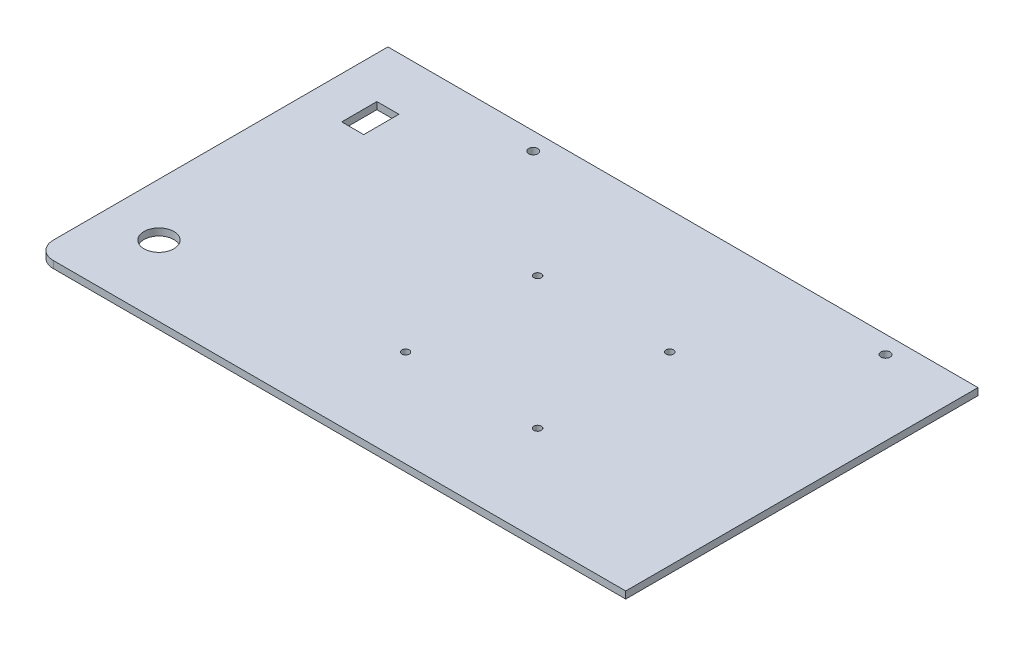
ISO-10303-21;
HEADER;
FILE_DESCRIPTION(('STEP AP214'),'2;1');
FILE_NAME('part.step','',(''),(''),'','','');
FILE_SCHEMA(('AUTOMOTIVE_DESIGN { 1 0 10303 214 1 1 1 1 }'));
ENDSEC;
DATA;
#1=APPLICATION_CONTEXT('core data for automotive mechanical design processes');
#2=APPLICATION_PROTOCOL_DEFINITION('international standard','automotive_design',2000,#1);
#3=PRODUCT_CONTEXT('',#1,'mechanical');
#4=PRODUCT('Part','Part','',(#3));
#5=PRODUCT_RELATED_PRODUCT_CATEGORY('part','',(#4));
#6=PRODUCT_DEFINITION_FORMATION('','',#4);
#7=PRODUCT_DEFINITION_CONTEXT('part definition',#1,'design');
#8=PRODUCT_DEFINITION('design','',#6,#7);
#9=PRODUCT_DEFINITION_SHAPE('','',#8);
#10=(LENGTH_UNIT() NAMED_UNIT(*) SI_UNIT(.MILLI.,.METRE.));
#11=(NAMED_UNIT(*) PLANE_ANGLE_UNIT() SI_UNIT($,.RADIAN.));
#12=(NAMED_UNIT(*) SI_UNIT($,.STERADIAN.) SOLID_ANGLE_UNIT());
#13=UNCERTAINTY_MEASURE_WITH_UNIT(LENGTH_MEASURE(1.E-05),#10,'distance_accuracy_value','');
#14=(GEOMETRIC_REPRESENTATION_CONTEXT(3) GLOBAL_UNCERTAINTY_ASSIGNED_CONTEXT((#13)) GLOBAL_UNIT_ASSIGNED_CONTEXT((#10,
#11,#12)) REPRESENTATION_CONTEXT('',''));
#15=CARTESIAN_POINT('',(0.,0.,0.));
#16=DIRECTION('',(0.,0.,1.));
#17=DIRECTION('',(1.,0.,0.));
#18=AXIS2_PLACEMENT_3D('',#15,#16,#17);
#19=CARTESIAN_POINT('',(142.5,4.,-100.));
#20=DIRECTION('',(-1.,0.,0.));
#21=DIRECTION('',(0.,0.,1.));
#22=AXIS2_PLACEMENT_3D('',#19,#20,#21);
#23=PLANE('',#22);
#24=DIRECTION('',(0.,0.,-1.));
#25=VECTOR('',#24,1.);
#26=CARTESIAN_POINT('',(142.5,0.,-100.));
#27=LINE('',#26,#25);
#28=CARTESIAN_POINT('',(142.5,0.,100.));
#29=VERTEX_POINT('',#28);
#30=CARTESIAN_POINT('',(142.5,0.,-100.));
#31=VERTEX_POINT('',#30);
#32=EDGE_CURVE('E226',#29,#31,#27,.T.);
#33=ORIENTED_EDGE('',*,*,#32,.T.);
#34=DIRECTION('',(0.,-1.,0.));
#35=VECTOR('',#34,1.);
#36=CARTESIAN_POINT('',(142.5,4.,-100.));
#37=LINE('',#36,#35);
#38=CARTESIAN_POINT('',(142.5,4.,-100.));
#39=VERTEX_POINT('',#38);
#40=EDGE_CURVE('E254',#39,#31,#37,.T.);
#41=ORIENTED_EDGE('',*,*,#40,.F.);
#42=DIRECTION('',(0.,0.,-1.));
#43=VECTOR('',#42,1.);
#44=CARTESIAN_POINT('',(142.5,4.,-100.));
#45=LINE('',#44,#43);
#46=CARTESIAN_POINT('',(142.5,4.,100.));
#47=VERTEX_POINT('',#46);
#48=EDGE_CURVE('E230',#47,#39,#45,.T.);
#49=ORIENTED_EDGE('',*,*,#48,.F.);
#50=DIRECTION('',(0.,-1.,0.));
#51=VECTOR('',#50,1.);
#52=CARTESIAN_POINT('',(142.5,4.,100.));
#53=LINE('',#52,#51);
#54=EDGE_CURVE('E242',#47,#29,#53,.T.);
#55=ORIENTED_EDGE('',*,*,#54,.T.);
#56=EDGE_LOOP('',(#33,#41,#49,#55));
#57=FACE_BOUND('',#56,.T.);
#58=ADVANCED_FACE('F41',(#57),#23,.F.);
#59=CARTESIAN_POINT('',(-142.5,4.,-100.));
#60=DIRECTION('',(0.,0.,1.));
#61=DIRECTION('',(1.,0.,0.));
#62=AXIS2_PLACEMENT_3D('',#59,#60,#61);
#63=PLANE('',#62);
#64=DIRECTION('',(-1.,0.,0.));
#65=VECTOR('',#64,1.);
#66=CARTESIAN_POINT('',(-142.5,0.,-100.));
#67=LINE('',#66,#65);
#68=CARTESIAN_POINT('',(-192.5,0.,-100.));
#69=VERTEX_POINT('',#68);
#70=EDGE_CURVE('E246',#31,#69,#67,.T.);
#71=ORIENTED_EDGE('',*,*,#70,.T.);
#72=DIRECTION('',(0.,-1.,0.));
#73=VECTOR('',#72,1.);
#74=CARTESIAN_POINT('',(-192.5,0.,-100.));
#75=LINE('',#74,#73);
#76=CARTESIAN_POINT('',(-192.5,4.,-100.));
#77=VERTEX_POINT('',#76);
#78=EDGE_CURVE('E169',#77,#69,#75,.T.);
#79=ORIENTED_EDGE('',*,*,#78,.F.);
#80=DIRECTION('',(-1.,0.,0.));
#81=VECTOR('',#80,1.);
#82=CARTESIAN_POINT('',(-142.5,4.,-100.));
#83=LINE('',#82,#81);
#84=EDGE_CURVE('E234',#39,#77,#83,.T.);
#85=ORIENTED_EDGE('',*,*,#84,.F.);
#86=ORIENTED_EDGE('',*,*,#40,.T.);
#87=EDGE_LOOP('',(#71,#79,#85,#86));
#88=FACE_BOUND('',#87,.T.);
#89=ADVANCED_FACE('F303',(#88),#63,.F.);
#90=CARTESIAN_POINT('',(-142.5,4.,100.));
#91=DIRECTION('',(0.,0.,-1.));
#92=DIRECTION('',(-1.,0.,0.));
#93=AXIS2_PLACEMENT_3D('',#90,#91,#92);
#94=PLANE('',#93);
#95=DIRECTION('',(1.,0.,0.));
#96=VECTOR('',#95,1.);
#97=CARTESIAN_POINT('',(-142.5,4.,100.));
#98=LINE('',#97,#96);
#99=CARTESIAN_POINT('',(-182.5,4.,100.));
#100=VERTEX_POINT('',#99);
#101=EDGE_CURVE('E239',#100,#47,#98,.T.);
#102=ORIENTED_EDGE('',*,*,#101,.F.);
#103=DIRECTION('',(0.,1.,0.));
#104=VECTOR('',#103,1.);
#105=CARTESIAN_POINT('',(-182.5,4.,100.));
#106=LINE('',#105,#104);
#107=CARTESIAN_POINT('',(-182.5,0.,100.));
#108=VERTEX_POINT('',#107);
#109=EDGE_CURVE('E50',#100,#108,#106,.F.);
#110=ORIENTED_EDGE('',*,*,#109,.T.);
#111=DIRECTION('',(1.,0.,0.));
#112=VECTOR('',#111,1.);
#113=CARTESIAN_POINT('',(-142.5,0.,100.));
#114=LINE('',#113,#112);
#115=EDGE_CURVE('E235',#108,#29,#114,.T.);
#116=ORIENTED_EDGE('',*,*,#115,.T.);
#117=ORIENTED_EDGE('',*,*,#54,.F.);
#118=EDGE_LOOP('',(#102,#110,#116,#117));
#119=FACE_BOUND('',#118,.T.);
#120=ADVANCED_FACE('F305',(#119),#94,.F.);
#121=CARTESIAN_POINT('',(0.,4.,0.));
#122=DIRECTION('',(0.,1.,0.));
#123=DIRECTION('',(0.,0.,1.));
#124=AXIS2_PLACEMENT_3D('',#121,#122,#123);
#125=PLANE('',#124);
#126=CARTESIAN_POINT('',(-162.5,4.,60.));
#127=DIRECTION('',(0.,-1.,0.));
#128=DIRECTION('',(0.,0.,-1.));
#129=AXIS2_PLACEMENT_3D('',#126,#127,#128);
#130=CIRCLE('',#129,8.50000000000001);
#131=CARTESIAN_POINT('',(-162.5,4.,51.5));
#132=VERTEX_POINT('',#131);
#133=EDGE_CURVE('E174',#132,#132,#130,.T.);
#134=ORIENTED_EDGE('',*,*,#133,.T.);
#135=EDGE_LOOP('',(#134));
#136=FACE_BOUND('',#135,.T.);
#137=DIRECTION('',(0.,0.,1.));
#138=VECTOR('',#137,1.);
#139=CARTESIAN_POINT('',(-156.25,4.,-50.));
#140=LINE('',#139,#138);
#141=CARTESIAN_POINT('',(-156.25,4.,-70.));
#142=VERTEX_POINT('',#141);
#143=CARTESIAN_POINT('',(-156.25,4.,-50.));
#144=VERTEX_POINT('',#143);
#145=EDGE_CURVE('E115',#142,#144,#140,.T.);
#146=ORIENTED_EDGE('',*,*,#145,.T.);
#147=DIRECTION('',(-1.,0.,0.));
#148=VECTOR('',#147,1.);
#149=CARTESIAN_POINT('',(-168.75,4.,-50.));
#150=LINE('',#149,#148);
#151=CARTESIAN_POINT('',(-168.75,4.,-50.));
#152=VERTEX_POINT('',#151);
#153=EDGE_CURVE('E128',#144,#152,#150,.T.);
#154=ORIENTED_EDGE('',*,*,#153,.T.);
#155=DIRECTION('',(0.,0.,-1.));
#156=VECTOR('',#155,1.);
#157=CARTESIAN_POINT('',(-168.75,4.,-50.));
#158=LINE('',#157,#156);
#159=CARTESIAN_POINT('',(-168.75,4.,-70.));
#160=VERTEX_POINT('',#159);
#161=EDGE_CURVE('E133',#152,#160,#158,.T.);
#162=ORIENTED_EDGE('',*,*,#161,.T.);
#163=DIRECTION('',(1.,0.,0.));
#164=VECTOR('',#163,1.);
#165=CARTESIAN_POINT('',(-168.75,4.,-70.));
#166=LINE('',#165,#164);
#167=EDGE_CURVE('E124',#160,#142,#166,.T.);
#168=ORIENTED_EDGE('',*,*,#167,.T.);
#169=EDGE_LOOP('',(#146,#154,#162,#168));
#170=FACE_BOUND('',#169,.T.);
#171=CARTESIAN_POINT('',(100.,4.,-90.));
#172=DIRECTION('',(0.,1.,0.));
#173=DIRECTION('',(0.,0.,-1.));
#174=AXIS2_PLACEMENT_3D('',#171,#172,#173);
#175=CIRCLE('',#174,2.6);
#176=CARTESIAN_POINT('',(100.,4.,-92.6));
#177=VERTEX_POINT('',#176);
#178=EDGE_CURVE('E181',#177,#177,#175,.T.);
#179=ORIENTED_EDGE('',*,*,#178,.F.);
#180=EDGE_LOOP('',(#179));
#181=FACE_BOUND('',#180,.T.);
#182=CARTESIAN_POINT('',(-100.,4.,-90.));
#183=DIRECTION('',(0.,1.,0.));
#184=DIRECTION('',(0.,0.,1.));
#185=AXIS2_PLACEMENT_3D('',#182,#183,#184);
#186=CIRCLE('',#185,2.6);
#187=CARTESIAN_POINT('',(-100.,4.,-87.4));
#188=VERTEX_POINT('',#187);
#189=EDGE_CURVE('E211',#188,#188,#186,.T.);
#190=ORIENTED_EDGE('',*,*,#189,.F.);
#191=EDGE_LOOP('',(#190));
#192=FACE_BOUND('',#191,.T.);
#193=CARTESIAN_POINT('',(-37.5,4.,45.));
#194=DIRECTION('',(0.,1.,0.));
#195=DIRECTION('',(0.,0.,-1.));
#196=AXIS2_PLACEMENT_3D('',#193,#194,#195);
#197=CIRCLE('',#196,2.1);
#198=CARTESIAN_POINT('',(-37.5,4.,42.9));
#199=VERTEX_POINT('',#198);
#200=EDGE_CURVE('E203',#199,#199,#197,.T.);
#201=ORIENTED_EDGE('',*,*,#200,.F.);
#202=EDGE_LOOP('',(#201));
#203=FACE_BOUND('',#202,.T.);
#204=CARTESIAN_POINT('',(37.5,4.,45.));
#205=DIRECTION('',(0.,1.,0.));
#206=DIRECTION('',(0.,0.,1.));
#207=AXIS2_PLACEMENT_3D('',#204,#205,#206);
#208=CIRCLE('',#207,2.1);
#209=CARTESIAN_POINT('',(37.5,4.,47.1));
#210=VERTEX_POINT('',#209);
#211=EDGE_CURVE('E195',#210,#210,#208,.T.);
#212=ORIENTED_EDGE('',*,*,#211,.F.);
#213=EDGE_LOOP('',(#212));
#214=FACE_BOUND('',#213,.T.);
#215=CARTESIAN_POINT('',(37.5,4.,-30.));
#216=DIRECTION('',(0.,1.,0.));
#217=DIRECTION('',(0.,0.,-1.));
#218=AXIS2_PLACEMENT_3D('',#215,#216,#217);
#219=CIRCLE('',#218,2.1);
#220=CARTESIAN_POINT('',(37.5,4.,-32.1));
#221=VERTEX_POINT('',#220);
#222=EDGE_CURVE('E187',#221,#221,#219,.T.);
#223=ORIENTED_EDGE('',*,*,#222,.F.);
#224=EDGE_LOOP('',(#223));
#225=FACE_BOUND('',#224,.T.);
#226=CARTESIAN_POINT('',(-37.5,4.,-30.));
#227=DIRECTION('',(0.,1.,0.));
#228=DIRECTION('',(0.,0.,1.));
#229=AXIS2_PLACEMENT_3D('',#226,#227,#228);
#230=CIRCLE('',#229,2.1);
#231=CARTESIAN_POINT('',(-37.5,4.,-27.9));
#232=VERTEX_POINT('',#231);
#233=EDGE_CURVE('E186',#232,#232,#230,.T.);
#234=ORIENTED_EDGE('',*,*,#233,.F.);
#235=EDGE_LOOP('',(#234));
#236=FACE_BOUND('',#235,.T.);
#237=DIRECTION('',(0.,0.,-1.));
#238=VECTOR('',#237,1.);
#239=CARTESIAN_POINT('',(-192.5,4.,-100.));
#240=LINE('',#239,#238);
#241=CARTESIAN_POINT('',(-192.5,4.,90.));
#242=VERTEX_POINT('',#241);
#243=EDGE_CURVE('E178',#242,#77,#240,.T.);
#244=ORIENTED_EDGE('',*,*,#243,.F.);
#245=CARTESIAN_POINT('',(-182.5,4.,90.));
#246=DIRECTION('',(0.,1.,0.));
#247=DIRECTION('',(0.,0.,1.));
#248=AXIS2_PLACEMENT_3D('',#245,#246,#247);
#249=CIRCLE('',#248,10.);
#250=EDGE_CURVE('E64',#242,#100,#249,.T.);
#251=ORIENTED_EDGE('',*,*,#250,.T.);
#252=ORIENTED_EDGE('',*,*,#101,.T.);
#253=ORIENTED_EDGE('',*,*,#48,.T.);
#254=ORIENTED_EDGE('',*,*,#84,.T.);
#255=EDGE_LOOP('',(#244,#251,#252,#253,#254));
#256=FACE_BOUND('',#255,.T.);
#257=ADVANCED_FACE('F135',(#136,#170,#181,#192,#203,#214,#225,#236,#256),#125,.T.);
#258=CARTESIAN_POINT('',(0.,0.,0.));
#259=DIRECTION('',(0.,1.,0.));
#260=DIRECTION('',(0.,0.,1.));
#261=AXIS2_PLACEMENT_3D('',#258,#259,#260);
#262=PLANE('',#261);
#263=CARTESIAN_POINT('',(-162.5,0.,60.));
#264=DIRECTION('',(0.,-1.,0.));
#265=DIRECTION('',(0.,0.,-1.));
#266=AXIS2_PLACEMENT_3D('',#263,#264,#265);
#267=CIRCLE('',#266,8.50000000000001);
#268=CARTESIAN_POINT('',(-162.5,0.,51.5));
#269=VERTEX_POINT('',#268);
#270=EDGE_CURVE('E146',#269,#269,#267,.T.);
#271=ORIENTED_EDGE('',*,*,#270,.F.);
#272=EDGE_LOOP('',(#271));
#273=FACE_BOUND('',#272,.T.);
#274=DIRECTION('',(-1.,0.,0.));
#275=VECTOR('',#274,1.);
#276=CARTESIAN_POINT('',(-168.75,0.,-50.));
#277=LINE('',#276,#275);
#278=CARTESIAN_POINT('',(-156.25,0.,-50.));
#279=VERTEX_POINT('',#278);
#280=CARTESIAN_POINT('',(-168.75,0.,-50.));
#281=VERTEX_POINT('',#280);
#282=EDGE_CURVE('E155',#279,#281,#277,.T.);
#283=ORIENTED_EDGE('',*,*,#282,.F.);
#284=DIRECTION('',(0.,0.,1.));
#285=VECTOR('',#284,1.);
#286=CARTESIAN_POINT('',(-156.25,0.,-50.));
#287=LINE('',#286,#285);
#288=CARTESIAN_POINT('',(-156.25,0.,-70.));
#289=VERTEX_POINT('',#288);
#290=EDGE_CURVE('E118',#289,#279,#287,.T.);
#291=ORIENTED_EDGE('',*,*,#290,.F.);
#292=DIRECTION('',(1.,0.,0.));
#293=VECTOR('',#292,1.);
#294=CARTESIAN_POINT('',(-168.75,0.,-70.));
#295=LINE('',#294,#293);
#296=CARTESIAN_POINT('',(-168.75,0.,-70.));
#297=VERTEX_POINT('',#296);
#298=EDGE_CURVE('E139',#297,#289,#295,.T.);
#299=ORIENTED_EDGE('',*,*,#298,.F.);
#300=DIRECTION('',(0.,0.,-1.));
#301=VECTOR('',#300,1.);
#302=CARTESIAN_POINT('',(-168.75,0.,-50.));
#303=LINE('',#302,#301);
#304=EDGE_CURVE('E143',#281,#297,#303,.T.);
#305=ORIENTED_EDGE('',*,*,#304,.F.);
#306=EDGE_LOOP('',(#283,#291,#299,#305));
#307=FACE_BOUND('',#306,.T.);
#308=CARTESIAN_POINT('',(100.,0.,-90.));
#309=DIRECTION('',(0.,1.,0.));
#310=DIRECTION('',(0.,0.,-1.));
#311=AXIS2_PLACEMENT_3D('',#308,#309,#310);
#312=CIRCLE('',#311,2.6);
#313=CARTESIAN_POINT('',(100.,0.,-92.6));
#314=VERTEX_POINT('',#313);
#315=EDGE_CURVE('E215',#314,#314,#312,.T.);
#316=ORIENTED_EDGE('',*,*,#315,.T.);
#317=EDGE_LOOP('',(#316));
#318=FACE_BOUND('',#317,.T.);
#319=CARTESIAN_POINT('',(-100.,0.,-90.));
#320=DIRECTION('',(0.,1.,0.));
#321=DIRECTION('',(0.,0.,1.));
#322=AXIS2_PLACEMENT_3D('',#319,#320,#321);
#323=CIRCLE('',#322,2.6);
#324=CARTESIAN_POINT('',(-100.,0.,-87.4));
#325=VERTEX_POINT('',#324);
#326=EDGE_CURVE('E207',#325,#325,#323,.T.);
#327=ORIENTED_EDGE('',*,*,#326,.T.);
#328=EDGE_LOOP('',(#327));
#329=FACE_BOUND('',#328,.T.);
#330=CARTESIAN_POINT('',(-37.5,0.,45.));
#331=DIRECTION('',(0.,1.,0.));
#332=DIRECTION('',(0.,0.,-1.));
#333=AXIS2_PLACEMENT_3D('',#330,#331,#332);
#334=CIRCLE('',#333,2.1);
#335=CARTESIAN_POINT('',(-37.5,0.,42.9));
#336=VERTEX_POINT('',#335);
#337=EDGE_CURVE('E199',#336,#336,#334,.T.);
#338=ORIENTED_EDGE('',*,*,#337,.T.);
#339=EDGE_LOOP('',(#338));
#340=FACE_BOUND('',#339,.T.);
#341=CARTESIAN_POINT('',(37.5,0.,45.));
#342=DIRECTION('',(0.,1.,0.));
#343=DIRECTION('',(0.,0.,1.));
#344=AXIS2_PLACEMENT_3D('',#341,#342,#343);
#345=CIRCLE('',#344,2.1);
#346=CARTESIAN_POINT('',(37.5,0.,47.1));
#347=VERTEX_POINT('',#346);
#348=EDGE_CURVE('E191',#347,#347,#345,.T.);
#349=ORIENTED_EDGE('',*,*,#348,.T.);
#350=EDGE_LOOP('',(#349));
#351=FACE_BOUND('',#350,.T.);
#352=CARTESIAN_POINT('',(37.5,0.,-30.));
#353=DIRECTION('',(0.,1.,0.));
#354=DIRECTION('',(0.,0.,-1.));
#355=AXIS2_PLACEMENT_3D('',#352,#353,#354);
#356=CIRCLE('',#355,2.1);
#357=CARTESIAN_POINT('',(37.5,0.,-32.1));
#358=VERTEX_POINT('',#357);
#359=EDGE_CURVE('E182',#358,#358,#356,.T.);
#360=ORIENTED_EDGE('',*,*,#359,.T.);
#361=EDGE_LOOP('',(#360));
#362=FACE_BOUND('',#361,.T.);
#363=CARTESIAN_POINT('',(-37.5,0.,-30.));
#364=DIRECTION('',(0.,1.,0.));
#365=DIRECTION('',(0.,0.,1.));
#366=AXIS2_PLACEMENT_3D('',#363,#364,#365);
#367=CIRCLE('',#366,2.1);
#368=CARTESIAN_POINT('',(-37.5,0.,-27.9));
#369=VERTEX_POINT('',#368);
#370=EDGE_CURVE('E222',#369,#369,#367,.T.);
#371=ORIENTED_EDGE('',*,*,#370,.T.);
#372=EDGE_LOOP('',(#371));
#373=FACE_BOUND('',#372,.T.);
#374=ORIENTED_EDGE('',*,*,#115,.F.);
#375=CARTESIAN_POINT('',(-182.5,0.,90.));
#376=DIRECTION('',(0.,1.,0.));
#377=DIRECTION('',(0.,0.,1.));
#378=AXIS2_PLACEMENT_3D('',#375,#376,#377);
#379=CIRCLE('',#378,10.);
#380=CARTESIAN_POINT('',(-192.5,0.,90.));
#381=VERTEX_POINT('',#380);
#382=EDGE_CURVE('E11',#108,#381,#379,.F.);
#383=ORIENTED_EDGE('',*,*,#382,.T.);
#384=DIRECTION('',(0.,0.,1.));
#385=VECTOR('',#384,1.);
#386=CARTESIAN_POINT('',(-192.5,0.,-100.));
#387=LINE('',#386,#385);
#388=EDGE_CURVE('E173',#69,#381,#387,.T.);
#389=ORIENTED_EDGE('',*,*,#388,.F.);
#390=ORIENTED_EDGE('',*,*,#70,.F.);
#391=ORIENTED_EDGE('',*,*,#32,.F.);
#392=EDGE_LOOP('',(#374,#383,#389,#390,#391));
#393=FACE_BOUND('',#392,.T.);
#394=ADVANCED_FACE('F272',(#273,#307,#318,#329,#340,#351,#362,#373,#393),#262,.F.);
#395=CARTESIAN_POINT('',(-37.5,0.,-30.));
#396=DIRECTION('',(0.,1.,0.));
#397=DIRECTION('',(0.,0.,1.));
#398=AXIS2_PLACEMENT_3D('',#395,#396,#397);
#399=CYLINDRICAL_SURFACE('',#398,2.1);
#400=ORIENTED_EDGE('',*,*,#370,.F.);
#401=EDGE_LOOP('',(#400));
#402=FACE_BOUND('',#401,.T.);
#403=ORIENTED_EDGE('',*,*,#233,.T.);
#404=EDGE_LOOP('',(#403));
#405=FACE_BOUND('',#404,.T.);
#406=ADVANCED_FACE('F275',(#402,#405),#399,.F.);
#407=CARTESIAN_POINT('',(37.5,0.,-30.));
#408=DIRECTION('',(0.,1.,0.));
#409=DIRECTION('',(0.,0.,1.));
#410=AXIS2_PLACEMENT_3D('',#407,#408,#409);
#411=CYLINDRICAL_SURFACE('',#410,2.1);
#412=ORIENTED_EDGE('',*,*,#359,.F.);
#413=EDGE_LOOP('',(#412));
#414=FACE_BOUND('',#413,.T.);
#415=ORIENTED_EDGE('',*,*,#222,.T.);
#416=EDGE_LOOP('',(#415));
#417=FACE_BOUND('',#416,.T.);
#418=ADVANCED_FACE('F446',(#414,#417),#411,.F.);
#419=CARTESIAN_POINT('',(37.5,0.,45.));
#420=DIRECTION('',(0.,1.,0.));
#421=DIRECTION('',(0.,0.,1.));
#422=AXIS2_PLACEMENT_3D('',#419,#420,#421);
#423=CYLINDRICAL_SURFACE('',#422,2.1);
#424=ORIENTED_EDGE('',*,*,#348,.F.);
#425=EDGE_LOOP('',(#424));
#426=FACE_BOUND('',#425,.T.);
#427=ORIENTED_EDGE('',*,*,#211,.T.);
#428=EDGE_LOOP('',(#427));
#429=FACE_BOUND('',#428,.T.);
#430=ADVANCED_FACE('F438',(#426,#429),#423,.F.);
#431=CARTESIAN_POINT('',(-37.5,0.,45.));
#432=DIRECTION('',(0.,1.,0.));
#433=DIRECTION('',(0.,0.,1.));
#434=AXIS2_PLACEMENT_3D('',#431,#432,#433);
#435=CYLINDRICAL_SURFACE('',#434,2.1);
#436=ORIENTED_EDGE('',*,*,#337,.F.);
#437=EDGE_LOOP('',(#436));
#438=FACE_BOUND('',#437,.T.);
#439=ORIENTED_EDGE('',*,*,#200,.T.);
#440=EDGE_LOOP('',(#439));
#441=FACE_BOUND('',#440,.T.);
#442=ADVANCED_FACE('F430',(#438,#441),#435,.F.);
#443=CARTESIAN_POINT('',(-100.,0.,-90.));
#444=DIRECTION('',(0.,1.,0.));
#445=DIRECTION('',(0.,0.,1.));
#446=AXIS2_PLACEMENT_3D('',#443,#444,#445);
#447=CYLINDRICAL_SURFACE('',#446,2.6);
#448=ORIENTED_EDGE('',*,*,#326,.F.);
#449=EDGE_LOOP('',(#448));
#450=FACE_BOUND('',#449,.T.);
#451=ORIENTED_EDGE('',*,*,#189,.T.);
#452=EDGE_LOOP('',(#451));
#453=FACE_BOUND('',#452,.T.);
#454=ADVANCED_FACE('F422',(#450,#453),#447,.F.);
#455=CARTESIAN_POINT('',(100.,0.,-90.));
#456=DIRECTION('',(0.,1.,0.));
#457=DIRECTION('',(0.,0.,1.));
#458=AXIS2_PLACEMENT_3D('',#455,#456,#457);
#459=CYLINDRICAL_SURFACE('',#458,2.6);
#460=ORIENTED_EDGE('',*,*,#315,.F.);
#461=EDGE_LOOP('',(#460));
#462=FACE_BOUND('',#461,.T.);
#463=ORIENTED_EDGE('',*,*,#178,.T.);
#464=EDGE_LOOP('',(#463));
#465=FACE_BOUND('',#464,.T.);
#466=ADVANCED_FACE('F366',(#462,#465),#459,.F.);
#467=CARTESIAN_POINT('',(-192.5,0.,0.));
#468=DIRECTION('',(1.,0.,0.));
#469=DIRECTION('',(0.,0.,-1.));
#470=AXIS2_PLACEMENT_3D('',#467,#468,#469);
#471=PLANE('',#470);
#472=ORIENTED_EDGE('',*,*,#388,.T.);
#473=DIRECTION('',(0.,1.,0.));
#474=VECTOR('',#473,1.);
#475=CARTESIAN_POINT('',(-192.5,0.,90.));
#476=LINE('',#475,#474);
#477=EDGE_CURVE('E258',#381,#242,#476,.T.);
#478=ORIENTED_EDGE('',*,*,#477,.T.);
#479=ORIENTED_EDGE('',*,*,#243,.T.);
#480=ORIENTED_EDGE('',*,*,#78,.T.);
#481=EDGE_LOOP('',(#472,#478,#479,#480));
#482=FACE_BOUND('',#481,.T.);
#483=ADVANCED_FACE('F298',(#482),#471,.F.);
#484=CARTESIAN_POINT('',(-156.25,4.,-50.));
#485=DIRECTION('',(1.,0.,0.));
#486=DIRECTION('',(0.,0.,-1.));
#487=AXIS2_PLACEMENT_3D('',#484,#485,#486);
#488=PLANE('',#487);
#489=ORIENTED_EDGE('',*,*,#290,.T.);
#490=DIRECTION('',(0.,-1.,0.));
#491=VECTOR('',#490,1.);
#492=CARTESIAN_POINT('',(-156.25,4.,-50.));
#493=LINE('',#492,#491);
#494=EDGE_CURVE('E111',#144,#279,#493,.T.);
#495=ORIENTED_EDGE('',*,*,#494,.F.);
#496=ORIENTED_EDGE('',*,*,#145,.F.);
#497=DIRECTION('',(0.,-1.,0.));
#498=VECTOR('',#497,1.);
#499=CARTESIAN_POINT('',(-156.25,4.,-70.));
#500=LINE('',#499,#498);
#501=EDGE_CURVE('E161',#142,#289,#500,.T.);
#502=ORIENTED_EDGE('',*,*,#501,.T.);
#503=EDGE_LOOP('',(#489,#495,#496,#502));
#504=FACE_BOUND('',#503,.T.);
#505=ADVANCED_FACE('F113',(#504),#488,.F.);
#506=CARTESIAN_POINT('',(-168.75,4.,-70.));
#507=DIRECTION('',(0.,0.,-1.));
#508=DIRECTION('',(-1.,0.,0.));
#509=AXIS2_PLACEMENT_3D('',#506,#507,#508);
#510=PLANE('',#509);
#511=ORIENTED_EDGE('',*,*,#298,.T.);
#512=ORIENTED_EDGE('',*,*,#501,.F.);
#513=ORIENTED_EDGE('',*,*,#167,.F.);
#514=DIRECTION('',(0.,-1.,0.));
#515=VECTOR('',#514,1.);
#516=CARTESIAN_POINT('',(-168.75,4.,-70.));
#517=LINE('',#516,#515);
#518=EDGE_CURVE('E164',#160,#297,#517,.T.);
#519=ORIENTED_EDGE('',*,*,#518,.T.);
#520=EDGE_LOOP('',(#511,#512,#513,#519));
#521=FACE_BOUND('',#520,.T.);
#522=ADVANCED_FACE('F374',(#521),#510,.F.);
#523=CARTESIAN_POINT('',(-168.75,4.,-50.));
#524=DIRECTION('',(-1.,0.,0.));
#525=DIRECTION('',(0.,0.,1.));
#526=AXIS2_PLACEMENT_3D('',#523,#524,#525);
#527=PLANE('',#526);
#528=ORIENTED_EDGE('',*,*,#304,.T.);
#529=ORIENTED_EDGE('',*,*,#518,.F.);
#530=ORIENTED_EDGE('',*,*,#161,.F.);
#531=DIRECTION('',(0.,-1.,0.));
#532=VECTOR('',#531,1.);
#533=CARTESIAN_POINT('',(-168.75,4.,-50.));
#534=LINE('',#533,#532);
#535=EDGE_CURVE('E123',#152,#281,#534,.T.);
#536=ORIENTED_EDGE('',*,*,#535,.T.);
#537=EDGE_LOOP('',(#528,#529,#530,#536));
#538=FACE_BOUND('',#537,.T.);
#539=ADVANCED_FACE('F382',(#538),#527,.F.);
#540=CARTESIAN_POINT('',(-168.75,4.,-50.));
#541=DIRECTION('',(0.,0.,1.));
#542=DIRECTION('',(1.,0.,0.));
#543=AXIS2_PLACEMENT_3D('',#540,#541,#542);
#544=PLANE('',#543);
#545=ORIENTED_EDGE('',*,*,#282,.T.);
#546=ORIENTED_EDGE('',*,*,#535,.F.);
#547=ORIENTED_EDGE('',*,*,#153,.F.);
#548=ORIENTED_EDGE('',*,*,#494,.T.);
#549=EDGE_LOOP('',(#545,#546,#547,#548));
#550=FACE_BOUND('',#549,.T.);
#551=ADVANCED_FACE('F129',(#550),#544,.F.);
#552=CARTESIAN_POINT('',(-162.5,4.,60.));
#553=DIRECTION('',(0.,-1.,0.));
#554=DIRECTION('',(0.,0.,-1.));
#555=AXIS2_PLACEMENT_3D('',#552,#553,#554);
#556=CYLINDRICAL_SURFACE('',#555,8.50000000000001);
#557=ORIENTED_EDGE('',*,*,#133,.F.);
#558=EDGE_LOOP('',(#557));
#559=FACE_BOUND('',#558,.T.);
#560=ORIENTED_EDGE('',*,*,#270,.T.);
#561=EDGE_LOOP('',(#560));
#562=FACE_BOUND('',#561,.T.);
#563=ADVANCED_FACE('F270',(#559,#562),#556,.F.);
#564=CARTESIAN_POINT('',(-182.5,0.,90.));
#565=DIRECTION('',(0.,1.,0.));
#566=DIRECTION('',(0.,0.,1.));
#567=AXIS2_PLACEMENT_3D('',#564,#565,#566);
#568=CYLINDRICAL_SURFACE('',#567,10.);
#569=ORIENTED_EDGE('',*,*,#382,.F.);
#570=ORIENTED_EDGE('',*,*,#109,.F.);
#571=ORIENTED_EDGE('',*,*,#250,.F.);
#572=ORIENTED_EDGE('',*,*,#477,.F.);
#573=EDGE_LOOP('',(#569,#570,#571,#572));
#574=FACE_BOUND('',#573,.T.);
#575=ADVANCED_FACE('F43',(#574),#568,.T.);
#576=CLOSED_SHELL('',(#58,#89,#120,#257,#394,#406,#418,#430,#442,#454,#466,#483,#505,#522,#539,
#551,#563,#575));
#577=MANIFOLD_SOLID_BREP('B2',#576);
#578=ADVANCED_BREP_SHAPE_REPRESENTATION('',(#18,#577),#14);
#579=SHAPE_DEFINITION_REPRESENTATION(#9,#578);
ENDSEC;
END-ISO-10303-21;
